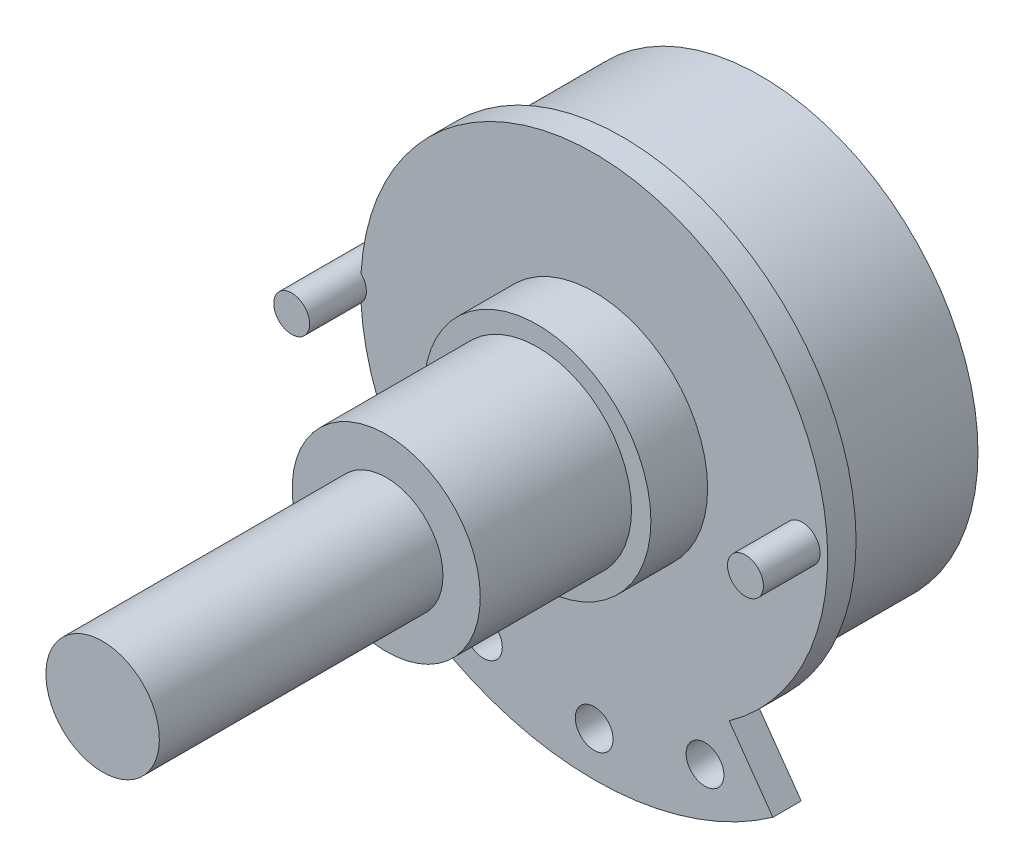
ISO-10303-21;
HEADER;
FILE_DESCRIPTION(('STEP AP214'),'2;1');
FILE_NAME('part.step','',(''),(''),'','','');
FILE_SCHEMA(('AUTOMOTIVE_DESIGN { 1 0 10303 214 1 1 1 1 }'));
ENDSEC;
DATA;
#1=APPLICATION_CONTEXT('core data for automotive mechanical design processes');
#2=APPLICATION_PROTOCOL_DEFINITION('international standard','automotive_design',2000,#1);
#3=PRODUCT_CONTEXT('',#1,'mechanical');
#4=PRODUCT('Part','Part','',(#3));
#5=PRODUCT_RELATED_PRODUCT_CATEGORY('part','',(#4));
#6=PRODUCT_DEFINITION_FORMATION('','',#4);
#7=PRODUCT_DEFINITION_CONTEXT('part definition',#1,'design');
#8=PRODUCT_DEFINITION('design','',#6,#7);
#9=PRODUCT_DEFINITION_SHAPE('','',#8);
#10=(LENGTH_UNIT() NAMED_UNIT(*) SI_UNIT(.MILLI.,.METRE.));
#11=(NAMED_UNIT(*) PLANE_ANGLE_UNIT() SI_UNIT($,.RADIAN.));
#12=(NAMED_UNIT(*) SI_UNIT($,.STERADIAN.) SOLID_ANGLE_UNIT());
#13=UNCERTAINTY_MEASURE_WITH_UNIT(LENGTH_MEASURE(1.E-05),#10,'distance_accuracy_value','');
#14=(GEOMETRIC_REPRESENTATION_CONTEXT(3) GLOBAL_UNCERTAINTY_ASSIGNED_CONTEXT((#13)) GLOBAL_UNIT_ASSIGNED_CONTEXT((#10,
#11,#12)) REPRESENTATION_CONTEXT('',''));
#15=CARTESIAN_POINT('',(0.,0.,0.));
#16=DIRECTION('',(0.,0.,1.));
#17=DIRECTION('',(1.,0.,0.));
#18=AXIS2_PLACEMENT_3D('',#15,#16,#17);
#19=CARTESIAN_POINT('',(0.,0.,8.8));
#20=DIRECTION('',(0.,0.,-1.));
#21=DIRECTION('',(-1.,0.,0.));
#22=AXIS2_PLACEMENT_3D('',#19,#20,#21);
#23=CYLINDRICAL_SURFACE('',#22,12.35);
#24=CARTESIAN_POINT('',(0.,0.,7.3));
#25=DIRECTION('',(0.,0.,1.));
#26=DIRECTION('',(1.,0.,0.));
#27=AXIS2_PLACEMENT_3D('',#24,#25,#26);
#28=CIRCLE('',#27,12.35);
#29=CARTESIAN_POINT('',(7.13807339449542,-10.0782145350651,7.3));
#30=VERTEX_POINT('',#29);
#31=CARTESIAN_POINT('',(-12.3315384615385,0.675025311819957,7.3));
#32=VERTEX_POINT('',#31);
#33=EDGE_CURVE('E95',#30,#32,#28,.T.);
#34=ORIENTED_EDGE('',*,*,#33,.T.);
#35=DIRECTION('',(0.,0.,1.));
#36=VECTOR('',#35,1.);
#37=CARTESIAN_POINT('',(-12.3315384615385,0.675025311819957,9.55));
#38=LINE('',#37,#36);
#39=CARTESIAN_POINT('',(-12.3315384615385,0.675025311819957,8.8));
#40=VERTEX_POINT('',#39);
#41=EDGE_CURVE('E11',#32,#40,#38,.T.);
#42=ORIENTED_EDGE('',*,*,#41,.T.);
#43=CARTESIAN_POINT('',(0.,0.,8.8));
#44=DIRECTION('',(0.,0.,1.));
#45=DIRECTION('',(1.,0.,0.));
#46=AXIS2_PLACEMENT_3D('',#43,#44,#45);
#47=CIRCLE('',#46,12.35);
#48=CARTESIAN_POINT('',(7.13807339449542,-10.0782145350651,8.8));
#49=VERTEX_POINT('',#48);
#50=EDGE_CURVE('E158',#49,#40,#47,.T.);
#51=ORIENTED_EDGE('',*,*,#50,.F.);
#52=DIRECTION('',(0.,0.,-1.));
#53=VECTOR('',#52,1.);
#54=CARTESIAN_POINT('',(7.13807339449542,-10.0782145350651,8.8));
#55=LINE('',#54,#53);
#56=EDGE_CURVE('E171',#49,#30,#55,.T.);
#57=ORIENTED_EDGE('',*,*,#56,.T.);
#58=EDGE_LOOP('',(#34,#42,#51,#57));
#59=FACE_BOUND('',#58,.T.);
#60=ADVANCED_FACE('F31',(#59),#23,.T.);
#61=CARTESIAN_POINT('',(0.,0.,19.8));
#62=DIRECTION('',(0.,0.,1.));
#63=DIRECTION('',(1.,0.,0.));
#64=AXIS2_PLACEMENT_3D('',#61,#62,#63);
#65=PLANE('',#64);
#66=CARTESIAN_POINT('',(0.,0.,19.8));
#67=DIRECTION('',(0.,0.,1.));
#68=DIRECTION('',(1.,0.,0.));
#69=AXIS2_PLACEMENT_3D('',#66,#67,#68);
#70=CIRCLE('',#69,4.975);
#71=CARTESIAN_POINT('',(4.975,0.,19.8));
#72=VERTEX_POINT('',#71);
#73=EDGE_CURVE('E123',#72,#72,#70,.T.);
#74=ORIENTED_EDGE('',*,*,#73,.T.);
#75=EDGE_LOOP('',(#74));
#76=FACE_BOUND('',#75,.T.);
#77=CARTESIAN_POINT('',(0.,0.,19.8));
#78=DIRECTION('',(0.,0.,1.));
#79=DIRECTION('',(1.,0.,0.));
#80=AXIS2_PLACEMENT_3D('',#77,#78,#79);
#81=CIRCLE('',#80,3.);
#82=CARTESIAN_POINT('',(3.,0.,19.8));
#83=VERTEX_POINT('',#82);
#84=EDGE_CURVE('E113',#83,#83,#81,.T.);
#85=ORIENTED_EDGE('',*,*,#84,.F.);
#86=EDGE_LOOP('',(#85));
#87=FACE_BOUND('',#86,.T.);
#88=ADVANCED_FACE('F197',(#76,#87),#65,.T.);
#89=CARTESIAN_POINT('',(0.,0.,11.8));
#90=DIRECTION('',(0.,0.,1.));
#91=DIRECTION('',(1.,0.,0.));
#92=AXIS2_PLACEMENT_3D('',#89,#90,#91);
#93=PLANE('',#92);
#94=CARTESIAN_POINT('',(0.,0.,11.8));
#95=DIRECTION('',(0.,0.,1.));
#96=DIRECTION('',(1.,0.,0.));
#97=AXIS2_PLACEMENT_3D('',#94,#95,#96);
#98=CIRCLE('',#97,6.);
#99=CARTESIAN_POINT('',(6.,0.,11.8));
#100=VERTEX_POINT('',#99);
#101=EDGE_CURVE('E129',#100,#100,#98,.T.);
#102=ORIENTED_EDGE('',*,*,#101,.T.);
#103=EDGE_LOOP('',(#102));
#104=FACE_BOUND('',#103,.T.);
#105=CARTESIAN_POINT('',(0.,0.,11.8));
#106=DIRECTION('',(0.,0.,1.));
#107=DIRECTION('',(1.,0.,0.));
#108=AXIS2_PLACEMENT_3D('',#105,#106,#107);
#109=CIRCLE('',#108,4.975);
#110=CARTESIAN_POINT('',(4.975,0.,11.8));
#111=VERTEX_POINT('',#110);
#112=EDGE_CURVE('E120',#111,#111,#109,.T.);
#113=ORIENTED_EDGE('',*,*,#112,.F.);
#114=EDGE_LOOP('',(#113));
#115=FACE_BOUND('',#114,.T.);
#116=ADVANCED_FACE('F202',(#104,#115),#93,.T.);
#117=CARTESIAN_POINT('',(0.,0.,8.8));
#118=DIRECTION('',(0.,0.,1.));
#119=DIRECTION('',(1.,0.,0.));
#120=AXIS2_PLACEMENT_3D('',#117,#118,#119);
#121=PLANE('',#120);
#122=CARTESIAN_POINT('',(-13.,0.,8.8));
#123=DIRECTION('',(0.,0.,1.));
#124=DIRECTION('',(1.,0.,0.));
#125=AXIS2_PLACEMENT_3D('',#122,#123,#124);
#126=CIRCLE('',#125,0.949999999999999);
#127=CARTESIAN_POINT('',(-12.3315384615385,-0.675025311819964,8.8));
#128=VERTEX_POINT('',#127);
#129=EDGE_CURVE('E46',#128,#40,#126,.T.);
#130=ORIENTED_EDGE('',*,*,#129,.F.);
#131=CARTESIAN_POINT('',(-7.13807339449541,-10.0782145350651,8.8));
#132=VERTEX_POINT('',#131);
#133=EDGE_CURVE('E100',#128,#132,#47,.T.);
#134=ORIENTED_EDGE('',*,*,#133,.T.);
#135=DIRECTION('',(-0.577981651376146,-0.816049759924297,0.));
#136=VECTOR('',#135,1.);
#137=CARTESIAN_POINT('',(-9.45,-13.3424135747623,8.8));
#138=LINE('',#137,#136);
#139=CARTESIAN_POINT('',(-9.45,-13.3424135747623,8.8));
#140=VERTEX_POINT('',#139);
#141=EDGE_CURVE('E160',#132,#140,#138,.T.);
#142=ORIENTED_EDGE('',*,*,#141,.T.);
#143=CARTESIAN_POINT('',(0.,0.,8.8));
#144=DIRECTION('',(0.,0.,1.));
#145=DIRECTION('',(1.,0.,0.));
#146=AXIS2_PLACEMENT_3D('',#143,#144,#145);
#147=CIRCLE('',#146,16.35);
#148=CARTESIAN_POINT('',(9.45,-13.3424135747623,8.8));
#149=VERTEX_POINT('',#148);
#150=EDGE_CURVE('E153',#140,#149,#147,.T.);
#151=ORIENTED_EDGE('',*,*,#150,.T.);
#152=DIRECTION('',(-0.577981651376146,0.816049759924297,0.));
#153=VECTOR('',#152,1.);
#154=CARTESIAN_POINT('',(7.13807339449541,-10.0782145350651,8.8));
#155=LINE('',#154,#153);
#156=EDGE_CURVE('E156',#149,#49,#155,.T.);
#157=ORIENTED_EDGE('',*,*,#156,.T.);
#158=ORIENTED_EDGE('',*,*,#50,.T.);
#159=EDGE_LOOP('',(#130,#134,#142,#151,#157,#158));
#160=FACE_BOUND('',#159,.T.);
#161=CARTESIAN_POINT('',(11.,0.,8.8));
#162=DIRECTION('',(0.,0.,1.));
#163=DIRECTION('',(1.,0.,0.));
#164=AXIS2_PLACEMENT_3D('',#161,#162,#163);
#165=CIRCLE('',#164,0.949999999999999);
#166=CARTESIAN_POINT('',(11.95,0.,8.8));
#167=VERTEX_POINT('',#166);
#168=EDGE_CURVE('E102',#167,#167,#165,.T.);
#169=ORIENTED_EDGE('',*,*,#168,.F.);
#170=EDGE_LOOP('',(#169));
#171=FACE_BOUND('',#170,.T.);
#172=CARTESIAN_POINT('',(0.,-14.,8.8));
#173=DIRECTION('',(0.,0.,1.));
#174=DIRECTION('',(1.,0.,0.));
#175=AXIS2_PLACEMENT_3D('',#172,#173,#174);
#176=CIRCLE('',#175,1.);
#177=CARTESIAN_POINT('',(1.,-14.,8.8));
#178=VERTEX_POINT('',#177);
#179=EDGE_CURVE('E144',#178,#178,#176,.T.);
#180=ORIENTED_EDGE('',*,*,#179,.F.);
#181=EDGE_LOOP('',(#180));
#182=FACE_BOUND('',#181,.T.);
#183=CARTESIAN_POINT('',(5.86062614193315,-12.7142857142857,8.8));
#184=DIRECTION('',(0.,0.,1.));
#185=DIRECTION('',(1.,0.,0.));
#186=AXIS2_PLACEMENT_3D('',#183,#184,#185);
#187=CIRCLE('',#186,1.);
#188=CARTESIAN_POINT('',(6.86062614193315,-12.7142857142857,8.8));
#189=VERTEX_POINT('',#188);
#190=EDGE_CURVE('E138',#189,#189,#187,.T.);
#191=ORIENTED_EDGE('',*,*,#190,.F.);
#192=EDGE_LOOP('',(#191));
#193=FACE_BOUND('',#192,.T.);
#194=CARTESIAN_POINT('',(-5.86062614193315,-12.7142857142857,8.8));
#195=DIRECTION('',(0.,0.,1.));
#196=DIRECTION('',(1.,0.,0.));
#197=AXIS2_PLACEMENT_3D('',#194,#195,#196);
#198=CIRCLE('',#197,1.);
#199=CARTESIAN_POINT('',(-4.86062614193315,-12.7142857142857,8.8));
#200=VERTEX_POINT('',#199);
#201=EDGE_CURVE('E132',#200,#200,#198,.T.);
#202=ORIENTED_EDGE('',*,*,#201,.F.);
#203=EDGE_LOOP('',(#202));
#204=FACE_BOUND('',#203,.T.);
#205=CARTESIAN_POINT('',(0.,0.,8.8));
#206=DIRECTION('',(0.,0.,1.));
#207=DIRECTION('',(1.,0.,0.));
#208=AXIS2_PLACEMENT_3D('',#205,#206,#207);
#209=CIRCLE('',#208,6.);
#210=CARTESIAN_POINT('',(6.,0.,8.8));
#211=VERTEX_POINT('',#210);
#212=EDGE_CURVE('E126',#211,#211,#209,.T.);
#213=ORIENTED_EDGE('',*,*,#212,.F.);
#214=EDGE_LOOP('',(#213));
#215=FACE_BOUND('',#214,.T.);
#216=ADVANCED_FACE('F193',(#160,#171,#182,#193,#204,#215),#121,.T.);
#217=CARTESIAN_POINT('',(0.,0.,7.3));
#218=DIRECTION('',(0.,0.,-1.));
#219=DIRECTION('',(-1.,0.,0.));
#220=AXIS2_PLACEMENT_3D('',#217,#218,#219);
#221=CYLINDRICAL_SURFACE('',#220,11.5);
#222=CARTESIAN_POINT('',(0.,0.,7.3));
#223=DIRECTION('',(0.,0.,1.));
#224=DIRECTION('',(1.,0.,0.));
#225=AXIS2_PLACEMENT_3D('',#222,#223,#224);
#226=CIRCLE('',#225,11.5);
#227=CARTESIAN_POINT('',(11.5,0.,7.3));
#228=VERTEX_POINT('',#227);
#229=EDGE_CURVE('E116',#228,#228,#226,.T.);
#230=ORIENTED_EDGE('',*,*,#229,.F.);
#231=EDGE_LOOP('',(#230));
#232=FACE_BOUND('',#231,.T.);
#233=CARTESIAN_POINT('',(0.,0.,0.));
#234=DIRECTION('',(0.,0.,1.));
#235=DIRECTION('',(1.,0.,0.));
#236=AXIS2_PLACEMENT_3D('',#233,#234,#235);
#237=CIRCLE('',#236,11.5);
#238=CARTESIAN_POINT('',(11.5,0.,0.));
#239=VERTEX_POINT('',#238);
#240=EDGE_CURVE('E177',#239,#239,#237,.T.);
#241=ORIENTED_EDGE('',*,*,#240,.T.);
#242=EDGE_LOOP('',(#241));
#243=FACE_BOUND('',#242,.T.);
#244=ADVANCED_FACE('F33',(#232,#243),#221,.T.);
#245=CARTESIAN_POINT('',(0.,0.,0.));
#246=DIRECTION('',(0.,0.,1.));
#247=DIRECTION('',(1.,0.,0.));
#248=AXIS2_PLACEMENT_3D('',#245,#246,#247);
#249=PLANE('',#248);
#250=ORIENTED_EDGE('',*,*,#240,.F.);
#251=EDGE_LOOP('',(#250));
#252=FACE_BOUND('',#251,.T.);
#253=ADVANCED_FACE('F184',(#252),#249,.F.);
#254=CARTESIAN_POINT('',(0.,0.,7.3));
#255=DIRECTION('',(0.,0.,1.));
#256=DIRECTION('',(1.,0.,0.));
#257=AXIS2_PLACEMENT_3D('',#254,#255,#256);
#258=PLANE('',#257);
#259=CARTESIAN_POINT('',(-5.86062614193315,-12.7142857142857,7.3));
#260=DIRECTION('',(0.,0.,1.));
#261=DIRECTION('',(1.,0.,0.));
#262=AXIS2_PLACEMENT_3D('',#259,#260,#261);
#263=CIRCLE('',#262,1.);
#264=CARTESIAN_POINT('',(-4.86062614193315,-12.7142857142857,7.3));
#265=VERTEX_POINT('',#264);
#266=EDGE_CURVE('E135',#265,#265,#263,.T.);
#267=ORIENTED_EDGE('',*,*,#266,.T.);
#268=EDGE_LOOP('',(#267));
#269=FACE_BOUND('',#268,.T.);
#270=CARTESIAN_POINT('',(5.86062614193315,-12.7142857142857,7.3));
#271=DIRECTION('',(0.,0.,1.));
#272=DIRECTION('',(1.,0.,0.));
#273=AXIS2_PLACEMENT_3D('',#270,#271,#272);
#274=CIRCLE('',#273,1.);
#275=CARTESIAN_POINT('',(6.86062614193315,-12.7142857142857,7.3));
#276=VERTEX_POINT('',#275);
#277=EDGE_CURVE('E141',#276,#276,#274,.T.);
#278=ORIENTED_EDGE('',*,*,#277,.T.);
#279=EDGE_LOOP('',(#278));
#280=FACE_BOUND('',#279,.T.);
#281=CARTESIAN_POINT('',(0.,-14.,7.3));
#282=DIRECTION('',(0.,0.,1.));
#283=DIRECTION('',(1.,0.,0.));
#284=AXIS2_PLACEMENT_3D('',#281,#282,#283);
#285=CIRCLE('',#284,1.);
#286=CARTESIAN_POINT('',(1.,-14.,7.3));
#287=VERTEX_POINT('',#286);
#288=EDGE_CURVE('E147',#287,#287,#285,.T.);
#289=ORIENTED_EDGE('',*,*,#288,.T.);
#290=EDGE_LOOP('',(#289));
#291=FACE_BOUND('',#290,.T.);
#292=CARTESIAN_POINT('',(-12.3315384615385,-0.675025311819957,7.3));
#293=VERTEX_POINT('',#292);
#294=CARTESIAN_POINT('',(-7.13807339449541,-10.0782145350651,7.3));
#295=VERTEX_POINT('',#294);
#296=EDGE_CURVE('E83',#293,#295,#28,.T.);
#297=ORIENTED_EDGE('',*,*,#296,.F.);
#298=CARTESIAN_POINT('',(-13.,0.,7.3));
#299=DIRECTION('',(0.,0.,1.));
#300=DIRECTION('',(1.,0.,0.));
#301=AXIS2_PLACEMENT_3D('',#298,#299,#300);
#302=CIRCLE('',#301,0.949999999999999);
#303=EDGE_CURVE('E89',#293,#32,#302,.F.);
#304=ORIENTED_EDGE('',*,*,#303,.T.);
#305=ORIENTED_EDGE('',*,*,#33,.F.);
#306=DIRECTION('',(-0.577981651376146,0.816049759924297,0.));
#307=VECTOR('',#306,1.);
#308=CARTESIAN_POINT('',(7.13807339449541,-10.0782145350651,7.3));
#309=LINE('',#308,#307);
#310=CARTESIAN_POINT('',(9.45,-13.3424135747623,7.3));
#311=VERTEX_POINT('',#310);
#312=EDGE_CURVE('E96',#311,#30,#309,.T.);
#313=ORIENTED_EDGE('',*,*,#312,.F.);
#314=CARTESIAN_POINT('',(0.,0.,7.3));
#315=DIRECTION('',(0.,0.,1.));
#316=DIRECTION('',(1.,0.,0.));
#317=AXIS2_PLACEMENT_3D('',#314,#315,#316);
#318=CIRCLE('',#317,16.35);
#319=CARTESIAN_POINT('',(-9.45,-13.3424135747623,7.3));
#320=VERTEX_POINT('',#319);
#321=EDGE_CURVE('E150',#320,#311,#318,.T.);
#322=ORIENTED_EDGE('',*,*,#321,.F.);
#323=DIRECTION('',(-0.577981651376146,-0.816049759924297,0.));
#324=VECTOR('',#323,1.);
#325=CARTESIAN_POINT('',(-9.45,-13.3424135747623,7.3));
#326=LINE('',#325,#324);
#327=EDGE_CURVE('E91',#295,#320,#326,.T.);
#328=ORIENTED_EDGE('',*,*,#327,.F.);
#329=EDGE_LOOP('',(#297,#304,#305,#313,#322,#328));
#330=FACE_BOUND('',#329,.T.);
#331=ORIENTED_EDGE('',*,*,#229,.T.);
#332=EDGE_LOOP('',(#331));
#333=FACE_BOUND('',#332,.T.);
#334=ADVANCED_FACE('F85',(#269,#280,#291,#330,#333),#258,.F.);
#335=CARTESIAN_POINT('',(0.,0.,8.8));
#336=DIRECTION('',(0.,0.,-1.));
#337=DIRECTION('',(-1.,0.,0.));
#338=AXIS2_PLACEMENT_3D('',#335,#336,#337);
#339=CYLINDRICAL_SURFACE('',#338,16.35);
#340=ORIENTED_EDGE('',*,*,#321,.T.);
#341=DIRECTION('',(0.,0.,-1.));
#342=VECTOR('',#341,1.);
#343=CARTESIAN_POINT('',(9.45,-13.3424135747623,8.8));
#344=LINE('',#343,#342);
#345=EDGE_CURVE('E174',#149,#311,#344,.T.);
#346=ORIENTED_EDGE('',*,*,#345,.F.);
#347=ORIENTED_EDGE('',*,*,#150,.F.);
#348=DIRECTION('',(0.,0.,-1.));
#349=VECTOR('',#348,1.);
#350=CARTESIAN_POINT('',(-9.45,-13.3424135747623,8.8));
#351=LINE('',#350,#349);
#352=EDGE_CURVE('E162',#140,#320,#351,.T.);
#353=ORIENTED_EDGE('',*,*,#352,.T.);
#354=EDGE_LOOP('',(#340,#346,#347,#353));
#355=FACE_BOUND('',#354,.T.);
#356=ADVANCED_FACE('F190',(#355),#339,.T.);
#357=CARTESIAN_POINT('',(7.13807339449541,-10.0782145350651,8.8));
#358=DIRECTION('',(-0.816049759924297,-0.577981651376146,0.));
#359=DIRECTION('',(0.577981651376146,-0.816049759924297,0.));
#360=AXIS2_PLACEMENT_3D('',#357,#358,#359);
#361=PLANE('',#360);
#362=ORIENTED_EDGE('',*,*,#312,.T.);
#363=ORIENTED_EDGE('',*,*,#56,.F.);
#364=ORIENTED_EDGE('',*,*,#156,.F.);
#365=ORIENTED_EDGE('',*,*,#345,.T.);
#366=EDGE_LOOP('',(#362,#363,#364,#365));
#367=FACE_BOUND('',#366,.T.);
#368=ADVANCED_FACE('F209',(#367),#361,.F.);
#369=ORIENTED_EDGE('',*,*,#133,.F.);
#370=DIRECTION('',(0.,0.,1.));
#371=VECTOR('',#370,1.);
#372=CARTESIAN_POINT('',(-12.3315384615385,-0.675025311819957,9.55));
#373=LINE('',#372,#371);
#374=EDGE_CURVE('E39',#128,#293,#373,.F.);
#375=ORIENTED_EDGE('',*,*,#374,.T.);
#376=ORIENTED_EDGE('',*,*,#296,.T.);
#377=DIRECTION('',(0.,0.,-1.));
#378=VECTOR('',#377,1.);
#379=CARTESIAN_POINT('',(-7.13807339449541,-10.0782145350651,8.8));
#380=LINE('',#379,#378);
#381=EDGE_CURVE('E169',#132,#295,#380,.T.);
#382=ORIENTED_EDGE('',*,*,#381,.F.);
#383=EDGE_LOOP('',(#369,#375,#376,#382));
#384=FACE_BOUND('',#383,.T.);
#385=ADVANCED_FACE('F99',(#384),#23,.T.);
#386=CARTESIAN_POINT('',(-9.45,-13.3424135747623,8.8));
#387=DIRECTION('',(0.816049759924297,-0.577981651376146,0.));
#388=DIRECTION('',(0.577981651376146,0.816049759924297,0.));
#389=AXIS2_PLACEMENT_3D('',#386,#387,#388);
#390=PLANE('',#389);
#391=ORIENTED_EDGE('',*,*,#327,.T.);
#392=ORIENTED_EDGE('',*,*,#352,.F.);
#393=ORIENTED_EDGE('',*,*,#141,.F.);
#394=ORIENTED_EDGE('',*,*,#381,.T.);
#395=EDGE_LOOP('',(#391,#392,#393,#394));
#396=FACE_BOUND('',#395,.T.);
#397=ADVANCED_FACE('F208',(#396),#390,.F.);
#398=CARTESIAN_POINT('',(0.,-14.,7.3));
#399=DIRECTION('',(0.,0.,1.));
#400=DIRECTION('',(1.,0.,0.));
#401=AXIS2_PLACEMENT_3D('',#398,#399,#400);
#402=CYLINDRICAL_SURFACE('',#401,1.);
#403=ORIENTED_EDGE('',*,*,#288,.F.);
#404=EDGE_LOOP('',(#403));
#405=FACE_BOUND('',#404,.T.);
#406=ORIENTED_EDGE('',*,*,#179,.T.);
#407=EDGE_LOOP('',(#406));
#408=FACE_BOUND('',#407,.T.);
#409=ADVANCED_FACE('F214',(#405,#408),#402,.F.);
#410=CARTESIAN_POINT('',(5.86062614193315,-12.7142857142857,7.3));
#411=DIRECTION('',(0.,0.,1.));
#412=DIRECTION('',(1.,0.,0.));
#413=AXIS2_PLACEMENT_3D('',#410,#411,#412);
#414=CYLINDRICAL_SURFACE('',#413,1.);
#415=ORIENTED_EDGE('',*,*,#277,.F.);
#416=EDGE_LOOP('',(#415));
#417=FACE_BOUND('',#416,.T.);
#418=ORIENTED_EDGE('',*,*,#190,.T.);
#419=EDGE_LOOP('',(#418));
#420=FACE_BOUND('',#419,.T.);
#421=ADVANCED_FACE('F252',(#417,#420),#414,.F.);
#422=CARTESIAN_POINT('',(-5.86062614193315,-12.7142857142857,7.3));
#423=DIRECTION('',(0.,0.,1.));
#424=DIRECTION('',(1.,0.,0.));
#425=AXIS2_PLACEMENT_3D('',#422,#423,#424);
#426=CYLINDRICAL_SURFACE('',#425,1.);
#427=ORIENTED_EDGE('',*,*,#266,.F.);
#428=EDGE_LOOP('',(#427));
#429=FACE_BOUND('',#428,.T.);
#430=ORIENTED_EDGE('',*,*,#201,.T.);
#431=EDGE_LOOP('',(#430));
#432=FACE_BOUND('',#431,.T.);
#433=ADVANCED_FACE('F242',(#429,#432),#426,.F.);
#434=CARTESIAN_POINT('',(0.,0.,11.8));
#435=DIRECTION('',(0.,0.,-1.));
#436=DIRECTION('',(-1.,0.,0.));
#437=AXIS2_PLACEMENT_3D('',#434,#435,#436);
#438=CYLINDRICAL_SURFACE('',#437,6.);
#439=ORIENTED_EDGE('',*,*,#101,.F.);
#440=EDGE_LOOP('',(#439));
#441=FACE_BOUND('',#440,.T.);
#442=ORIENTED_EDGE('',*,*,#212,.T.);
#443=EDGE_LOOP('',(#442));
#444=FACE_BOUND('',#443,.T.);
#445=ADVANCED_FACE('F239',(#441,#444),#438,.T.);
#446=CARTESIAN_POINT('',(0.,0.,19.8));
#447=DIRECTION('',(0.,0.,-1.));
#448=DIRECTION('',(-1.,0.,0.));
#449=AXIS2_PLACEMENT_3D('',#446,#447,#448);
#450=CYLINDRICAL_SURFACE('',#449,4.975);
#451=ORIENTED_EDGE('',*,*,#73,.F.);
#452=EDGE_LOOP('',(#451));
#453=FACE_BOUND('',#452,.T.);
#454=ORIENTED_EDGE('',*,*,#112,.T.);
#455=EDGE_LOOP('',(#454));
#456=FACE_BOUND('',#455,.T.);
#457=ADVANCED_FACE('F241',(#453,#456),#450,.T.);
#458=CARTESIAN_POINT('',(0.,0.,34.8));
#459=DIRECTION('',(0.,0.,-1.));
#460=DIRECTION('',(-1.,0.,0.));
#461=AXIS2_PLACEMENT_3D('',#458,#459,#460);
#462=CYLINDRICAL_SURFACE('',#461,3.);
#463=CARTESIAN_POINT('',(0.,0.,34.8));
#464=DIRECTION('',(0.,0.,1.));
#465=DIRECTION('',(1.,0.,0.));
#466=AXIS2_PLACEMENT_3D('',#463,#464,#465);
#467=CIRCLE('',#466,3.);
#468=CARTESIAN_POINT('',(3.,0.,34.8));
#469=VERTEX_POINT('',#468);
#470=EDGE_CURVE('E117',#469,#469,#467,.T.);
#471=ORIENTED_EDGE('',*,*,#470,.F.);
#472=EDGE_LOOP('',(#471));
#473=FACE_BOUND('',#472,.T.);
#474=ORIENTED_EDGE('',*,*,#84,.T.);
#475=EDGE_LOOP('',(#474));
#476=FACE_BOUND('',#475,.T.);
#477=ADVANCED_FACE('F249',(#473,#476),#462,.T.);
#478=CARTESIAN_POINT('',(0.,0.,34.8));
#479=DIRECTION('',(0.,0.,1.));
#480=DIRECTION('',(1.,0.,0.));
#481=AXIS2_PLACEMENT_3D('',#478,#479,#480);
#482=PLANE('',#481);
#483=ORIENTED_EDGE('',*,*,#470,.T.);
#484=EDGE_LOOP('',(#483));
#485=FACE_BOUND('',#484,.T.);
#486=ADVANCED_FACE('F312',(#485),#482,.T.);
#487=CARTESIAN_POINT('',(11.,0.,4.61299423149112));
#488=DIRECTION('',(0.,0.,1.));
#489=DIRECTION('',(1.,0.,0.));
#490=AXIS2_PLACEMENT_3D('',#487,#488,#489);
#491=CYLINDRICAL_SURFACE('',#490,0.949999999999999);
#492=ORIENTED_EDGE('',*,*,#168,.T.);
#493=EDGE_LOOP('',(#492));
#494=FACE_BOUND('',#493,.T.);
#495=CARTESIAN_POINT('',(11.,0.,11.8));
#496=DIRECTION('',(0.,0.,1.));
#497=DIRECTION('',(1.,0.,0.));
#498=AXIS2_PLACEMENT_3D('',#495,#496,#497);
#499=CIRCLE('',#498,0.949999999999999);
#500=CARTESIAN_POINT('',(11.95,0.,11.8));
#501=VERTEX_POINT('',#500);
#502=EDGE_CURVE('E106',#501,#501,#499,.T.);
#503=ORIENTED_EDGE('',*,*,#502,.F.);
#504=EDGE_LOOP('',(#503));
#505=FACE_BOUND('',#504,.T.);
#506=ADVANCED_FACE('F321',(#494,#505),#491,.T.);
#507=CARTESIAN_POINT('',(11.,0.,11.8));
#508=DIRECTION('',(0.,0.,1.));
#509=DIRECTION('',(1.,0.,0.));
#510=AXIS2_PLACEMENT_3D('',#507,#508,#509);
#511=PLANE('',#510);
#512=ORIENTED_EDGE('',*,*,#502,.T.);
#513=EDGE_LOOP('',(#512));
#514=FACE_BOUND('',#513,.T.);
#515=ADVANCED_FACE('F361',(#514),#511,.T.);
#516=CARTESIAN_POINT('',(-13.,0.,4.61299423149112));
#517=DIRECTION('',(0.,0.,1.));
#518=DIRECTION('',(1.,0.,0.));
#519=AXIS2_PLACEMENT_3D('',#516,#517,#518);
#520=CYLINDRICAL_SURFACE('',#519,0.949999999999999);
#521=CARTESIAN_POINT('',(-13.,0.,11.8));
#522=DIRECTION('',(0.,0.,1.));
#523=DIRECTION('',(1.,0.,0.));
#524=AXIS2_PLACEMENT_3D('',#521,#522,#523);
#525=CIRCLE('',#524,0.949999999999999);
#526=CARTESIAN_POINT('',(-12.05,0.,11.8));
#527=VERTEX_POINT('',#526);
#528=EDGE_CURVE('E104',#527,#527,#525,.T.);
#529=ORIENTED_EDGE('',*,*,#528,.F.);
#530=EDGE_LOOP('',(#529));
#531=FACE_BOUND('',#530,.T.);
#532=ORIENTED_EDGE('',*,*,#41,.F.);
#533=ORIENTED_EDGE('',*,*,#303,.F.);
#534=ORIENTED_EDGE('',*,*,#374,.F.);
#535=ORIENTED_EDGE('',*,*,#129,.T.);
#536=EDGE_LOOP('',(#532,#533,#534,#535));
#537=FACE_BOUND('',#536,.T.);
#538=ADVANCED_FACE('F103',(#531,#537),#520,.T.);
#539=CARTESIAN_POINT('',(-13.,0.,11.8));
#540=DIRECTION('',(0.,0.,1.));
#541=DIRECTION('',(1.,0.,0.));
#542=AXIS2_PLACEMENT_3D('',#539,#540,#541);
#543=PLANE('',#542);
#544=ORIENTED_EDGE('',*,*,#528,.T.);
#545=EDGE_LOOP('',(#544));
#546=FACE_BOUND('',#545,.T.);
#547=ADVANCED_FACE('F380',(#546),#543,.T.);
#548=CLOSED_SHELL('',(#60,#88,#116,#216,#244,#253,#334,#356,#368,#385,#397,#409,#421,#433,#445,
#457,#477,#486,#506,#515,#538,#547));
#549=MANIFOLD_SOLID_BREP('B2',#548);
#550=ADVANCED_BREP_SHAPE_REPRESENTATION('',(#18,#549),#14);
#551=SHAPE_DEFINITION_REPRESENTATION(#9,#550);
ENDSEC;
END-ISO-10303-21;
